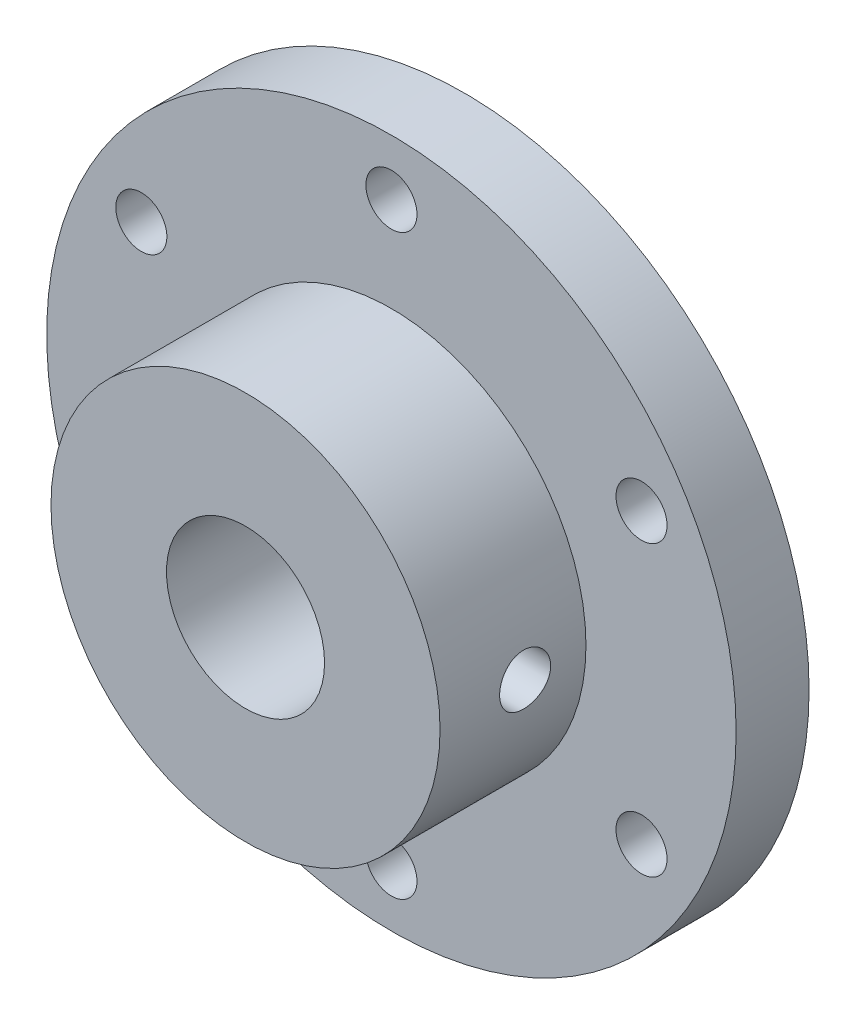
ISO-10303-21;
HEADER;
FILE_DESCRIPTION(('STEP AP214'),'2;1');
FILE_NAME('part.step','',(''),(''),'','','');
FILE_SCHEMA(('AUTOMOTIVE_DESIGN { 1 0 10303 214 1 1 1 1 }'));
ENDSEC;
DATA;
#1=APPLICATION_CONTEXT('core data for automotive mechanical design processes');
#2=APPLICATION_PROTOCOL_DEFINITION('international standard','automotive_design',2000,#1);
#3=PRODUCT_CONTEXT('',#1,'mechanical');
#4=PRODUCT('Part','Part','',(#3));
#5=PRODUCT_RELATED_PRODUCT_CATEGORY('part','',(#4));
#6=PRODUCT_DEFINITION_FORMATION('','',#4);
#7=PRODUCT_DEFINITION_CONTEXT('part definition',#1,'design');
#8=PRODUCT_DEFINITION('design','',#6,#7);
#9=PRODUCT_DEFINITION_SHAPE('','',#8);
#10=(LENGTH_UNIT() NAMED_UNIT(*) SI_UNIT(.MILLI.,.METRE.));
#11=(NAMED_UNIT(*) PLANE_ANGLE_UNIT() SI_UNIT($,.RADIAN.));
#12=(NAMED_UNIT(*) SI_UNIT($,.STERADIAN.) SOLID_ANGLE_UNIT());
#13=UNCERTAINTY_MEASURE_WITH_UNIT(LENGTH_MEASURE(1.E-05),#10,'distance_accuracy_value','');
#14=(GEOMETRIC_REPRESENTATION_CONTEXT(3) GLOBAL_UNCERTAINTY_ASSIGNED_CONTEXT((#13)) GLOBAL_UNIT_ASSIGNED_CONTEXT((#10,
#11,#12)) REPRESENTATION_CONTEXT('',''));
#15=CARTESIAN_POINT('',(0.,0.,0.));
#16=DIRECTION('',(0.,0.,1.));
#17=DIRECTION('',(1.,0.,0.));
#18=AXIS2_PLACEMENT_3D('',#15,#16,#17);
#19=CARTESIAN_POINT('',(0.,0.,6.));
#20=DIRECTION('',(0.,0.,-1.));
#21=DIRECTION('',(-1.,0.,0.));
#22=AXIS2_PLACEMENT_3D('',#19,#20,#21);
#23=CYLINDRICAL_SURFACE('',#22,28.35);
#24=CARTESIAN_POINT('',(0.,0.,6.));
#25=DIRECTION('',(0.,0.,1.));
#26=DIRECTION('',(1.,0.,0.));
#27=AXIS2_PLACEMENT_3D('',#24,#25,#26);
#28=CIRCLE('',#27,28.35);
#29=CARTESIAN_POINT('',(28.35,0.,6.));
#30=VERTEX_POINT('',#29);
#31=EDGE_CURVE('E10',#30,#30,#28,.T.);
#32=ORIENTED_EDGE('',*,*,#31,.F.);
#33=EDGE_LOOP('',(#32));
#34=FACE_BOUND('',#33,.T.);
#35=CARTESIAN_POINT('',(0.,0.,0.));
#36=DIRECTION('',(0.,0.,1.));
#37=DIRECTION('',(1.,0.,0.));
#38=AXIS2_PLACEMENT_3D('',#35,#36,#37);
#39=CIRCLE('',#38,28.35);
#40=CARTESIAN_POINT('',(28.35,0.,0.));
#41=VERTEX_POINT('',#40);
#42=EDGE_CURVE('E33',#41,#41,#39,.T.);
#43=ORIENTED_EDGE('',*,*,#42,.T.);
#44=EDGE_LOOP('',(#43));
#45=FACE_BOUND('',#44,.T.);
#46=ADVANCED_FACE('F30',(#34,#45),#23,.T.);
#47=CARTESIAN_POINT('',(0.,0.,6.));
#48=DIRECTION('',(0.,0.,1.));
#49=DIRECTION('',(1.,0.,0.));
#50=AXIS2_PLACEMENT_3D('',#47,#48,#49);
#51=PLANE('',#50);
#52=CARTESIAN_POINT('',(-20.5681033398804,-11.8750000000001,6.));
#53=DIRECTION('',(0.,0.,1.));
#54=DIRECTION('',(-0.500000000000004,0.866025403784436,0.));
#55=AXIS2_PLACEMENT_3D('',#52,#53,#54);
#56=CIRCLE('',#55,2.09999999999999);
#57=CARTESIAN_POINT('',(-21.6181033398804,-10.0563466520528,6.));
#58=VERTEX_POINT('',#57);
#59=EDGE_CURVE('E83',#58,#58,#56,.T.);
#60=ORIENTED_EDGE('',*,*,#59,.F.);
#61=EDGE_LOOP('',(#60));
#62=FACE_BOUND('',#61,.T.);
#63=CARTESIAN_POINT('',(0.,-23.75,6.));
#64=DIRECTION('',(0.,0.,1.));
#65=DIRECTION('',(-1.,0.,0.));
#66=AXIS2_PLACEMENT_3D('',#63,#64,#65);
#67=CIRCLE('',#66,2.09999999999999);
#68=CARTESIAN_POINT('',(-2.09999999999999,-23.75,6.));
#69=VERTEX_POINT('',#68);
#70=EDGE_CURVE('E77',#69,#69,#67,.T.);
#71=ORIENTED_EDGE('',*,*,#70,.F.);
#72=EDGE_LOOP('',(#71));
#73=FACE_BOUND('',#72,.T.);
#74=CARTESIAN_POINT('',(20.5681033398805,-11.8749999999998,6.));
#75=DIRECTION('',(0.,0.,1.));
#76=DIRECTION('',(-0.499999999999992,-0.866025403784443,0.));
#77=AXIS2_PLACEMENT_3D('',#74,#75,#76);
#78=CIRCLE('',#77,2.09999999999999);
#79=CARTESIAN_POINT('',(19.5181033398806,-13.6936533479471,6.));
#80=VERTEX_POINT('',#79);
#81=EDGE_CURVE('E69',#80,#80,#78,.T.);
#82=ORIENTED_EDGE('',*,*,#81,.F.);
#83=EDGE_LOOP('',(#82));
#84=FACE_BOUND('',#83,.T.);
#85=CARTESIAN_POINT('',(20.5681033398803,11.8750000000002,6.));
#86=DIRECTION('',(0.,0.,1.));
#87=DIRECTION('',(0.50000000000001,-0.866025403784433,0.));
#88=AXIS2_PLACEMENT_3D('',#85,#86,#87);
#89=CIRCLE('',#88,2.09999999999999);
#90=CARTESIAN_POINT('',(21.6181033398803,10.0563466520529,6.));
#91=VERTEX_POINT('',#90);
#92=EDGE_CURVE('E70',#91,#91,#89,.T.);
#93=ORIENTED_EDGE('',*,*,#92,.F.);
#94=EDGE_LOOP('',(#93));
#95=FACE_BOUND('',#94,.T.);
#96=CARTESIAN_POINT('',(-20.5681033398804,11.875,6.));
#97=DIRECTION('',(0.,0.,1.));
#98=DIRECTION('',(0.499999999999998,0.86602540378444,0.));
#99=AXIS2_PLACEMENT_3D('',#96,#97,#98);
#100=CIRCLE('',#99,2.09999999999999);
#101=CARTESIAN_POINT('',(-19.5181033398805,13.6936533479473,6.));
#102=VERTEX_POINT('',#101);
#103=EDGE_CURVE('E62',#102,#102,#100,.T.);
#104=ORIENTED_EDGE('',*,*,#103,.F.);
#105=EDGE_LOOP('',(#104));
#106=FACE_BOUND('',#105,.T.);
#107=CARTESIAN_POINT('',(0.,23.75,6.));
#108=DIRECTION('',(0.,0.,1.));
#109=DIRECTION('',(1.,0.,0.));
#110=AXIS2_PLACEMENT_3D('',#107,#108,#109);
#111=CIRCLE('',#110,2.09999999999999);
#112=CARTESIAN_POINT('',(2.09999999999999,23.75,6.));
#113=VERTEX_POINT('',#112);
#114=EDGE_CURVE('E51',#113,#113,#111,.T.);
#115=ORIENTED_EDGE('',*,*,#114,.F.);
#116=EDGE_LOOP('',(#115));
#117=FACE_BOUND('',#116,.T.);
#118=CARTESIAN_POINT('',(0.,0.,6.));
#119=DIRECTION('',(0.,0.,1.));
#120=DIRECTION('',(1.,0.,0.));
#121=AXIS2_PLACEMENT_3D('',#118,#119,#120);
#122=CIRCLE('',#121,16.);
#123=CARTESIAN_POINT('',(16.,0.,6.));
#124=VERTEX_POINT('',#123);
#125=EDGE_CURVE('E42',#124,#124,#122,.T.);
#126=ORIENTED_EDGE('',*,*,#125,.F.);
#127=EDGE_LOOP('',(#126));
#128=FACE_BOUND('',#127,.T.);
#129=ORIENTED_EDGE('',*,*,#31,.T.);
#130=EDGE_LOOP('',(#129));
#131=FACE_BOUND('',#130,.T.);
#132=ADVANCED_FACE('F143',(#62,#73,#84,#95,#106,#117,#128,#131),#51,.T.);
#133=CARTESIAN_POINT('',(0.,0.,0.));
#134=DIRECTION('',(0.,0.,1.));
#135=DIRECTION('',(1.,0.,0.));
#136=AXIS2_PLACEMENT_3D('',#133,#134,#135);
#137=PLANE('',#136);
#138=CARTESIAN_POINT('',(-20.5681033398804,-11.8750000000001,0.));
#139=DIRECTION('',(0.,0.,-1.));
#140=DIRECTION('',(0.500000000000004,-0.866025403784436,0.));
#141=AXIS2_PLACEMENT_3D('',#138,#139,#140);
#142=CIRCLE('',#141,2.09999999999999);
#143=CARTESIAN_POINT('',(-19.5181033398804,-13.6936533479474,0.));
#144=VERTEX_POINT('',#143);
#145=EDGE_CURVE('E65',#144,#144,#142,.T.);
#146=ORIENTED_EDGE('',*,*,#145,.F.);
#147=EDGE_LOOP('',(#146));
#148=FACE_BOUND('',#147,.T.);
#149=CARTESIAN_POINT('',(0.,-23.75,0.));
#150=DIRECTION('',(0.,0.,-1.));
#151=DIRECTION('',(1.,0.,0.));
#152=AXIS2_PLACEMENT_3D('',#149,#150,#151);
#153=CIRCLE('',#152,2.09999999999999);
#154=CARTESIAN_POINT('',(2.09999999999999,-23.75,0.));
#155=VERTEX_POINT('',#154);
#156=EDGE_CURVE('E80',#155,#155,#153,.T.);
#157=ORIENTED_EDGE('',*,*,#156,.F.);
#158=EDGE_LOOP('',(#157));
#159=FACE_BOUND('',#158,.T.);
#160=CARTESIAN_POINT('',(20.5681033398805,-11.8749999999998,0.));
#161=DIRECTION('',(0.,0.,-1.));
#162=DIRECTION('',(0.499999999999992,0.866025403784443,0.));
#163=AXIS2_PLACEMENT_3D('',#160,#161,#162);
#164=CIRCLE('',#163,2.09999999999999);
#165=CARTESIAN_POINT('',(21.6181033398805,-10.0563466520525,0.));
#166=VERTEX_POINT('',#165);
#167=EDGE_CURVE('E74',#166,#166,#164,.T.);
#168=ORIENTED_EDGE('',*,*,#167,.F.);
#169=EDGE_LOOP('',(#168));
#170=FACE_BOUND('',#169,.T.);
#171=CARTESIAN_POINT('',(20.5681033398803,11.8750000000002,0.));
#172=DIRECTION('',(0.,0.,-1.));
#173=DIRECTION('',(-0.50000000000001,0.866025403784433,0.));
#174=AXIS2_PLACEMENT_3D('',#171,#172,#173);
#175=CIRCLE('',#174,2.09999999999999);
#176=CARTESIAN_POINT('',(19.5181033398803,13.6936533479475,0.));
#177=VERTEX_POINT('',#176);
#178=EDGE_CURVE('E66',#177,#177,#175,.T.);
#179=ORIENTED_EDGE('',*,*,#178,.F.);
#180=EDGE_LOOP('',(#179));
#181=FACE_BOUND('',#180,.T.);
#182=CARTESIAN_POINT('',(-20.5681033398804,11.875,0.));
#183=DIRECTION('',(0.,0.,-1.));
#184=DIRECTION('',(-0.499999999999998,-0.86602540378444,0.));
#185=AXIS2_PLACEMENT_3D('',#182,#183,#184);
#186=CIRCLE('',#185,2.09999999999999);
#187=CARTESIAN_POINT('',(-21.6181033398804,10.0563466520526,0.));
#188=VERTEX_POINT('',#187);
#189=EDGE_CURVE('E59',#188,#188,#186,.T.);
#190=ORIENTED_EDGE('',*,*,#189,.F.);
#191=EDGE_LOOP('',(#190));
#192=FACE_BOUND('',#191,.T.);
#193=CARTESIAN_POINT('',(0.,23.75,0.));
#194=DIRECTION('',(0.,0.,-1.));
#195=DIRECTION('',(-1.,0.,0.));
#196=AXIS2_PLACEMENT_3D('',#193,#194,#195);
#197=CIRCLE('',#196,2.09999999999999);
#198=CARTESIAN_POINT('',(-2.09999999999999,23.75,0.));
#199=VERTEX_POINT('',#198);
#200=EDGE_CURVE('E56',#199,#199,#197,.T.);
#201=ORIENTED_EDGE('',*,*,#200,.F.);
#202=EDGE_LOOP('',(#201));
#203=FACE_BOUND('',#202,.T.);
#204=CARTESIAN_POINT('',(0.,0.,0.));
#205=DIRECTION('',(0.,0.,1.));
#206=DIRECTION('',(1.,0.,0.));
#207=AXIS2_PLACEMENT_3D('',#204,#205,#206);
#208=CIRCLE('',#207,6.5);
#209=CARTESIAN_POINT('',(6.5,0.,0.));
#210=VERTEX_POINT('',#209);
#211=EDGE_CURVE('E45',#210,#210,#208,.T.);
#212=ORIENTED_EDGE('',*,*,#211,.T.);
#213=EDGE_LOOP('',(#212));
#214=FACE_BOUND('',#213,.T.);
#215=ORIENTED_EDGE('',*,*,#42,.F.);
#216=EDGE_LOOP('',(#215));
#217=FACE_BOUND('',#216,.T.);
#218=ADVANCED_FACE('F141',(#148,#159,#170,#181,#192,#203,#214,#217),#137,.F.);
#219=CARTESIAN_POINT('',(0.,0.,18.));
#220=DIRECTION('',(0.,0.,-1.));
#221=DIRECTION('',(-1.,0.,0.));
#222=AXIS2_PLACEMENT_3D('',#219,#220,#221);
#223=CYLINDRICAL_SURFACE('',#222,16.);
#224=CARTESIAN_POINT('',(16.,0.,8.9));
#225=CARTESIAN_POINT('',(15.9999982962631,0.117416484353102,8.90000495705236));
#226=CARTESIAN_POINT('',(15.9986938773925,0.234905122011887,8.90988080691643));
#227=CARTESIAN_POINT('',(15.9936157778764,0.466609665583491,8.94911967052718));
#228=CARTESIAN_POINT('',(15.9898395595276,0.580822081998048,8.97850271201433));
#229=CARTESIAN_POINT('',(15.9802430281394,0.802586512568987,9.0558724099226));
#230=CARTESIAN_POINT('',(15.9744241309754,0.910143079615394,9.10384618263218));
#231=CARTESIAN_POINT('',(15.9613884397463,1.1156593399402,9.21700655797674));
#232=CARTESIAN_POINT('',(15.9541718747973,1.21362060219517,9.28219034005324));
#233=CARTESIAN_POINT('',(15.9390970395828,1.39777717587375,9.4283413083698));
#234=CARTESIAN_POINT('',(15.9312355150333,1.48390610575507,9.50939181113075));
#235=CARTESIAN_POINT('',(15.9157828604001,1.64138117851605,9.68479647193949));
#236=CARTESIAN_POINT('',(15.908191744508,1.71272654645484,9.77915132695387));
#237=CARTESIAN_POINT('',(15.8941075163014,1.83885928171324,9.9789213126258));
#238=CARTESIAN_POINT('',(15.8876186009931,1.89358395666576,10.0843763480338));
#239=CARTESIAN_POINT('',(15.8765168113299,1.98452144739535,10.3030795517579));
#240=CARTESIAN_POINT('',(15.8719038586674,2.02073503589053,10.4163273945506));
#241=CARTESIAN_POINT('',(15.8651076274545,2.0734195616491,10.6467101739999));
#242=CARTESIAN_POINT('',(15.8629105101852,2.0900029894288,10.7638189706013));
#243=CARTESIAN_POINT('',(15.8611524584727,2.10330463008907,10.9991763708029));
#244=CARTESIAN_POINT('',(15.8615914075016,2.10002372107694,11.1174249237892));
#245=CARTESIAN_POINT('',(15.8650432287045,2.07378206445453,11.3509187553438));
#246=CARTESIAN_POINT('',(15.86803985239,2.05094554741099,11.4661782702577));
#247=CARTESIAN_POINT('',(15.8762440291591,1.98643489899058,11.6912149779756));
#248=CARTESIAN_POINT('',(15.8814516312202,1.94476035031288,11.8009920492725));
#249=CARTESIAN_POINT('',(15.8935093147413,1.84362411100889,12.0123317781193));
#250=CARTESIAN_POINT('',(15.9003643391794,1.78410875473803,12.1138684605443));
#251=CARTESIAN_POINT('',(15.9149407211294,1.64901867206017,12.3055604124573));
#252=CARTESIAN_POINT('',(15.9226621222936,1.57344313629226,12.395715107979));
#253=CARTESIAN_POINT('',(15.9381733835384,1.40769104741128,12.5628047526722));
#254=CARTESIAN_POINT('',(15.9459633163989,1.31740747591083,12.6396335731953));
#255=CARTESIAN_POINT('',(15.9606788849759,1.12516973659487,12.7770631591691));
#256=CARTESIAN_POINT('',(15.9676045183355,1.02321553695397,12.8376638803649));
#257=CARTESIAN_POINT('',(15.9798160936183,0.81044643682083,12.9409183626589));
#258=CARTESIAN_POINT('',(15.9851013953531,0.699628098002016,12.9835651189946));
#259=CARTESIAN_POINT('',(15.9934311173904,0.472318289200564,13.0496149743927));
#260=CARTESIAN_POINT('',(15.9964756534268,0.355827112547463,13.0730190673325));
#261=CARTESIAN_POINT('',(15.9999656992249,0.12139562938738,13.0997808566157));
#262=CARTESIAN_POINT('',(16.0004301540478,0.00347227541262437,13.103284681241));
#263=CARTESIAN_POINT('',(15.9987589549612,-0.231280014343777,13.0905326292899));
#264=CARTESIAN_POINT('',(15.9966233622396,-0.348108975814989,13.0742772177153));
#265=CARTESIAN_POINT('',(15.990003800972,-0.57692228410594,13.0225895536893));
#266=CARTESIAN_POINT('',(15.9855284102365,-0.688922719796447,12.9872273319612));
#267=CARTESIAN_POINT('',(15.974730073111,-0.905403997412976,12.8984029024912));
#268=CARTESIAN_POINT('',(15.9684070581947,-1.00988456025589,12.8449400234038));
#269=CARTESIAN_POINT('',(15.9545706371482,-1.2090105555854,12.721080854769));
#270=CARTESIAN_POINT('',(15.947050698098,-1.30359699513709,12.6505904659569));
#271=CARTESIAN_POINT('',(15.9316811346644,-1.47964872574463,12.4948098674338));
#272=CARTESIAN_POINT('',(15.9238314958089,-1.56111344006267,12.4095190075414));
#273=CARTESIAN_POINT('',(15.9086283992346,-1.70913080865221,12.2259132317372));
#274=CARTESIAN_POINT('',(15.9012783770394,-1.77558633636806,12.1275196890213));
#275=CARTESIAN_POINT('',(15.8879642527691,-1.89102695628024,11.9208813855286));
#276=CARTESIAN_POINT('',(15.8820001205454,-1.94001242853153,11.8126368391213));
#277=CARTESIAN_POINT('',(15.8721568354206,-2.01896672841903,11.5896770175875));
#278=CARTESIAN_POINT('',(15.8682717771357,-2.04898946191644,11.4749811034711));
#279=CARTESIAN_POINT('',(15.8630098837321,-2.08933920892608,11.242121268751));
#280=CARTESIAN_POINT('',(15.8616329189455,-2.09966724065019,11.1239575277539));
#281=CARTESIAN_POINT('',(15.8615471546198,-2.10031443069061,10.8884829294453));
#282=CARTESIAN_POINT('',(15.8628180045269,-2.09078619999575,10.7711724699154));
#283=CARTESIAN_POINT('',(15.8678408142836,-2.05231540968838,10.5398362007954));
#284=CARTESIAN_POINT('',(15.8715927735212,-2.02337285486407,10.4258103903953));
#285=CARTESIAN_POINT('',(15.8811485642185,-1.94694420408523,10.2043055075203));
#286=CARTESIAN_POINT('',(15.8869514953252,-1.89946624400469,10.096823586585));
#287=CARTESIAN_POINT('',(15.8999567709492,-1.78732950445978,9.89132723687448));
#288=CARTESIAN_POINT('',(15.9071591400699,-1.7226704229297,9.79331297459389));
#289=CARTESIAN_POINT('',(15.9222180092564,-1.57744326503153,9.60875508025564));
#290=CARTESIAN_POINT('',(15.9300789344295,-1.49676157774286,9.52230120152492));
#291=CARTESIAN_POINT('',(15.9455305998353,-1.32201773458277,9.36410229468749));
#292=CARTESIAN_POINT('',(15.9531212761728,-1.22795244033518,9.29236072619036));
#293=CARTESIAN_POINT('',(15.9672126278133,-1.02865642383035,9.16536363306548));
#294=CARTESIAN_POINT('',(15.9737086069784,-0.923380607893781,9.11017838182219));
#295=CARTESIAN_POINT('',(15.9848315489309,-0.705026961411323,9.01835047192647));
#296=CARTESIAN_POINT('',(15.9894605194548,-0.591957665878867,8.98168788366503));
#297=CARTESIAN_POINT('',(15.9952257223333,-0.398600577498265,8.93661582244385));
#298=CARTESIAN_POINT('',(15.9970072452264,-0.319526543474694,8.92290490974843));
#299=CARTESIAN_POINT('',(15.9993949607654,-0.160312880332424,8.90459534461191));
#300=CARTESIAN_POINT('',(16.0000011633302,-0.0801732602122652,8.89999661527041));
#301=CARTESIAN_POINT('',(16.,0.,8.9));
#302=B_SPLINE_CURVE_WITH_KNOTS('',3,(#224,#225,#226,#227,#228,#229,#230,#231,#232,#233,#234,
#235,#236,#237,#238,#239,#240,#241,#242,#243,#244,#245,#246,#247,#248,#249,#250,#251,#252,#253,
#254,#255,#256,#257,#258,#259,#260,#261,#262,#263,#264,#265,#266,#267,#268,#269,#270,#271,#272,
#273,#274,#275,#276,#277,#278,#279,#280,#281,#282,#283,#284,#285,#286,#287,#288,#289,#290,#291,
#292,#293,#294,#295,#296,#297,#298,#299,#300,#301),.UNSPECIFIED.,.T.,.F.,(4,2,2,2,2,2,2,2,2,2,2,
2,2,2,2,2,2,2,2,2,2,2,2,2,2,2,2,2,2,2,2,2,2,2,2,2,2,2,4),(0.,0.351956579597512,
0.704275067694988,1.05634982812868,1.40836692260358,1.76228460352201,2.11622083179281,
2.47147596652804,2.82671627044793,3.17991086217002,3.53308984096312,3.88404169036012,
4.2350013144372,4.58702741286475,4.9390712560353,5.29380151830567,5.64853274793558,
6.00340224843457,6.35825341888271,6.71049550361346,7.06272929905446,7.41368075090289,
7.76464522081314,8.11759548065947,8.47056124946069,8.82574953425382,9.18093009157842,
9.53509636913481,9.88924433587379,10.2406804386663,10.5921164547833,10.9433983857755,
11.2946864931543,11.6485606276522,12.0025178807118,12.3579569170413,12.7130126970205,
12.9533345286082,13.1936543320409),.UNSPECIFIED.);
#303=CARTESIAN_POINT('',(16.,0.,8.9));
#304=VERTEX_POINT('',#303);
#305=EDGE_CURVE('E73',#304,#304,#302,.T.);
#306=ORIENTED_EDGE('',*,*,#305,.F.);
#307=EDGE_LOOP('',(#306));
#308=FACE_BOUND('',#307,.T.);
#309=CARTESIAN_POINT('',(0.,0.,18.));
#310=DIRECTION('',(0.,0.,1.));
#311=DIRECTION('',(1.,0.,0.));
#312=AXIS2_PLACEMENT_3D('',#309,#310,#311);
#313=CIRCLE('',#312,16.);
#314=CARTESIAN_POINT('',(16.,0.,18.));
#315=VERTEX_POINT('',#314);
#316=EDGE_CURVE('E40',#315,#315,#313,.T.);
#317=ORIENTED_EDGE('',*,*,#316,.F.);
#318=EDGE_LOOP('',(#317));
#319=FACE_BOUND('',#318,.T.);
#320=ORIENTED_EDGE('',*,*,#125,.T.);
#321=EDGE_LOOP('',(#320));
#322=FACE_BOUND('',#321,.T.);
#323=ADVANCED_FACE('F137',(#308,#319,#322),#223,.T.);
#324=CARTESIAN_POINT('',(0.,0.,18.));
#325=DIRECTION('',(0.,0.,1.));
#326=DIRECTION('',(1.,0.,0.));
#327=AXIS2_PLACEMENT_3D('',#324,#325,#326);
#328=PLANE('',#327);
#329=CARTESIAN_POINT('',(0.,0.,18.));
#330=DIRECTION('',(0.,0.,1.));
#331=DIRECTION('',(1.,0.,0.));
#332=AXIS2_PLACEMENT_3D('',#329,#330,#331);
#333=CIRCLE('',#332,6.5);
#334=CARTESIAN_POINT('',(6.5,0.,18.));
#335=VERTEX_POINT('',#334);
#336=EDGE_CURVE('E48',#335,#335,#333,.T.);
#337=ORIENTED_EDGE('',*,*,#336,.F.);
#338=EDGE_LOOP('',(#337));
#339=FACE_BOUND('',#338,.T.);
#340=ORIENTED_EDGE('',*,*,#316,.T.);
#341=EDGE_LOOP('',(#340));
#342=FACE_BOUND('',#341,.T.);
#343=ADVANCED_FACE('F133',(#339,#342),#328,.T.);
#344=CARTESIAN_POINT('',(0.,0.,0.));
#345=DIRECTION('',(0.,0.,1.));
#346=DIRECTION('',(1.,0.,0.));
#347=AXIS2_PLACEMENT_3D('',#344,#345,#346);
#348=CYLINDRICAL_SURFACE('',#347,6.5);
#349=CARTESIAN_POINT('',(6.5,0.,8.9));
#350=CARTESIAN_POINT('',(6.49999984762594,-0.11478015267852,8.90000013326097));
#351=CARTESIAN_POINT('',(6.49693136614676,-0.229562646212126,8.90944116425099));
#352=CARTESIAN_POINT('',(6.48499201245018,-0.455758735968136,8.94684858951265));
#353=CARTESIAN_POINT('',(6.47612018587026,-0.567171774928909,8.97481803079873));
#354=CARTESIAN_POINT('',(6.45354073761235,-0.783334943692378,9.04823192886978));
#355=CARTESIAN_POINT('',(6.43984090576822,-0.888095487627853,9.09364824624092));
#356=CARTESIAN_POINT('',(6.40901183916854,-1.08851351392821,9.20054322424069));
#357=CARTESIAN_POINT('',(6.39188199424108,-1.18416937216913,9.2620247433346));
#358=CARTESIAN_POINT('',(6.35537555243329,-1.36679767568749,9.40142339988139));
#359=CARTESIAN_POINT('',(6.33594753880125,-1.45343019593023,9.47977234832067));
#360=CARTESIAN_POINT('',(6.29732467015338,-1.61258241008024,9.64976310716213));
#361=CARTESIAN_POINT('',(6.27812986315358,-1.6850992423096,9.74140760641673));
#362=CARTESIAN_POINT('',(6.24158803844324,-1.81585313888028,9.93838942073292));
#363=CARTESIAN_POINT('',(6.22430408492323,-1.87365695616513,10.0440271375786));
#364=CARTESIAN_POINT('',(6.19431848653863,-1.97053521369596,10.2641730612946));
#365=CARTESIAN_POINT('',(6.18161553983706,-2.00961497600927,10.3786787368016));
#366=CARTESIAN_POINT('',(6.16276983931889,-2.06667622660958,10.6094591201013));
#367=CARTESIAN_POINT('',(6.15643057256345,-2.0852915301278,10.7255606061229));
#368=CARTESIAN_POINT('',(6.15044761140108,-2.10287625070446,10.9593986910689));
#369=CARTESIAN_POINT('',(6.15080199454799,-2.101851308528,11.0771348108124));
#370=CARTESIAN_POINT('',(6.15799345504348,-2.08067854494973,11.3055768377815));
#371=CARTESIAN_POINT('',(6.16455379741828,-2.06134700904493,11.4163686019231));
#372=CARTESIAN_POINT('',(6.18296679592779,-2.00543737492302,11.6330430309594));
#373=CARTESIAN_POINT('',(6.1948200499337,-1.96885732834052,11.7389251397825));
#374=CARTESIAN_POINT('',(6.22268788340782,-1.87893383724714,11.94467403774));
#375=CARTESIAN_POINT('',(6.23876362994827,-1.82534134925149,12.0444233394089));
#376=CARTESIAN_POINT('',(6.2732382947439,-1.70308717246323,12.2337759870639));
#377=CARTESIAN_POINT('',(6.29163785022376,-1.6344213464996,12.3233765372721));
#378=CARTESIAN_POINT('',(6.32978643852367,-1.48000669369173,12.4944892936782));
#379=CARTESIAN_POINT('',(6.34955748594388,-1.39358721886844,12.5753925649043));
#380=CARTESIAN_POINT('',(6.38743186866717,-1.20816261133916,12.7217118952384));
#381=CARTESIAN_POINT('',(6.40553506275021,-1.10915641457954,12.7871266436411));
#382=CARTESIAN_POINT('',(6.43824721057395,-0.900136372310454,12.9010630861593));
#383=CARTESIAN_POINT('',(6.45282391669772,-0.790033092396686,12.9494305995234));
#384=CARTESIAN_POINT('',(6.47660732137455,-0.562670821437449,13.0267726307963));
#385=CARTESIAN_POINT('',(6.48581576747844,-0.4454141728024,13.0557534601823));
#386=CARTESIAN_POINT('',(6.49753974554395,-0.2122355686941,13.0924414490988));
#387=CARTESIAN_POINT('',(6.50031423039758,-0.0964560310383877,13.1009721849127));
#388=CARTESIAN_POINT('',(6.49962893282386,0.134897611158433,13.0988518883504));
#389=CARTESIAN_POINT('',(6.49617013124436,0.250471745156622,13.0882038738745));
#390=CARTESIAN_POINT('',(6.48357748396053,0.474897398486163,13.0486849183147));
#391=CARTESIAN_POINT('',(6.47459876244501,0.583846122334336,13.0203117592815));
#392=CARTESIAN_POINT('',(6.4520280403984,0.795399868811156,12.9467627922165));
#393=CARTESIAN_POINT('',(6.43843545964271,0.898004091655654,12.9015848708016));
#394=CARTESIAN_POINT('',(6.40759659592119,1.09685611026068,12.7944320236055));
#395=CARTESIAN_POINT('',(6.39026632979125,1.19287645758089,12.7320598528519));
#396=CARTESIAN_POINT('',(6.35392571159687,1.37335993471932,12.5927605608013));
#397=CARTESIAN_POINT('',(6.33491487544933,1.45781971658139,12.5158292384573));
#398=CARTESIAN_POINT('',(6.29633442103443,1.61651818338125,12.3457209755327));
#399=CARTESIAN_POINT('',(6.27677542522803,1.69016938349652,12.2519922563222));
#400=CARTESIAN_POINT('',(6.24014795835414,1.82076055180556,12.053082794392));
#401=CARTESIAN_POINT('',(6.22307947542276,1.87770059960644,11.9479021062294));
#402=CARTESIAN_POINT('',(6.19354517835395,1.97293988416012,11.7291691602628));
#403=CARTESIAN_POINT('',(6.18106547836716,2.0112954720899,11.6156434271912));
#404=CARTESIAN_POINT('',(6.16226449334382,2.06819042623144,11.3832533722931));
#405=CARTESIAN_POINT('',(6.15594065306915,2.08673801486373,11.2643912869866));
#406=CARTESIAN_POINT('',(6.15044597744328,2.10287398644436,11.0308786474295));
#407=CARTESIAN_POINT('',(6.1509443099754,2.1014317073017,10.9163020737839));
#408=CARTESIAN_POINT('',(6.15822697913326,2.07999175555092,10.6891122898019));
#409=CARTESIAN_POINT('',(6.1650109834417,2.05999506389632,10.5764989759905));
#410=CARTESIAN_POINT('',(6.18386170119516,2.0026819067383,10.3582971845668));
#411=CARTESIAN_POINT('',(6.19583805979404,1.96566104718839,10.2526226560169));
#412=CARTESIAN_POINT('',(6.22369569223963,1.87558632651302,10.0489019638837));
#413=CARTESIAN_POINT('',(6.23957779800492,1.82252904910129,9.95085743134324));
#414=CARTESIAN_POINT('',(6.27427773405697,1.69932067816035,9.7607816701388));
#415=CARTESIAN_POINT('',(6.29318990404038,1.62855266631233,9.66916762849268));
#416=CARTESIAN_POINT('',(6.33140503172638,1.47299576999185,9.49880177489966));
#417=CARTESIAN_POINT('',(6.35070809559453,1.38820303038323,9.42005351137916));
#418=CARTESIAN_POINT('',(6.38835851966061,1.20335860583316,9.27482546498718));
#419=CARTESIAN_POINT('',(6.40664701425018,1.10286967112843,9.20888514525647));
#420=CARTESIAN_POINT('',(6.43943829822981,0.891645850173484,9.09491304176281));
#421=CARTESIAN_POINT('',(6.45394231934155,0.780914313486271,9.04687542907176));
#422=CARTESIAN_POINT('',(6.4767469097158,0.559731443724438,8.97283194592696));
#423=CARTESIAN_POINT('',(6.48538779223929,0.449724427071784,8.94560293582374));
#424=CARTESIAN_POINT('',(6.49701374152978,0.226478517537958,8.90918903792171));
#425=CARTESIAN_POINT('',(6.50000015032999,0.113240398005008,8.89999986852671));
#426=CARTESIAN_POINT('',(6.5,0.,8.9));
#427=B_SPLINE_CURVE_WITH_KNOTS('',3,(#349,#350,#351,#352,#353,#354,#355,#356,#357,#358,#359,
#360,#361,#362,#363,#364,#365,#366,#367,#368,#369,#370,#371,#372,#373,#374,#375,#376,#377,#378,
#379,#380,#381,#382,#383,#384,#385,#386,#387,#388,#389,#390,#391,#392,#393,#394,#395,#396,#397,
#398,#399,#400,#401,#402,#403,#404,#405,#406,#407,#408,#409,#410,#411,#412,#413,#414,#415,#416,
#417,#418,#419,#420,#421,#422,#423,#424,#425,#426),.UNSPECIFIED.,.T.,.F.,(4,2,2,2,2,2,2,2,2,2,2,
2,2,2,2,2,2,2,2,2,2,2,2,2,2,2,2,2,2,2,2,2,2,2,2,2,2,2,4),(0.,0.343923981095444,
0.687904534857075,1.0313326088658,1.37482183034691,1.72845644393134,2.08216267547618,
2.4453183332506,2.80837070746089,3.15983101194152,3.51119037698753,3.84758565907629,
4.18401894896814,4.52562389865709,4.86732272596724,5.22571361317307,5.58413481812311,
5.94571918962466,6.30718578731836,6.65383086592771,7.00042140245966,7.33769086053154,
7.67500274828454,8.02087649799565,8.36685020225929,8.72753837967963,9.08822483885801,
9.44781068404835,9.80724720488736,10.1493177330619,10.4913701773347,10.8276953457348,
11.1640922130562,11.5144204767655,11.8648451997129,12.2278019086183,12.5906403392817,
12.9300312044731,13.2693415085097),.UNSPECIFIED.);
#428=CARTESIAN_POINT('',(6.5,0.,8.9));
#429=VERTEX_POINT('',#428);
#430=EDGE_CURVE('E97',#429,#429,#427,.T.);
#431=ORIENTED_EDGE('',*,*,#430,.F.);
#432=EDGE_LOOP('',(#431));
#433=FACE_BOUND('',#432,.T.);
#434=ORIENTED_EDGE('',*,*,#211,.F.);
#435=EDGE_LOOP('',(#434));
#436=FACE_BOUND('',#435,.T.);
#437=ORIENTED_EDGE('',*,*,#336,.T.);
#438=EDGE_LOOP('',(#437));
#439=FACE_BOUND('',#438,.T.);
#440=ADVANCED_FACE('F129',(#433,#436,#439),#348,.F.);
#441=CARTESIAN_POINT('',(0.,23.75,0.));
#442=DIRECTION('',(0.,0.,-1.));
#443=DIRECTION('',(-1.,0.,0.));
#444=AXIS2_PLACEMENT_3D('',#441,#442,#443);
#445=CYLINDRICAL_SURFACE('',#444,2.09999999999999);
#446=ORIENTED_EDGE('',*,*,#114,.T.);
#447=EDGE_LOOP('',(#446));
#448=FACE_BOUND('',#447,.T.);
#449=ORIENTED_EDGE('',*,*,#200,.T.);
#450=EDGE_LOOP('',(#449));
#451=FACE_BOUND('',#450,.T.);
#452=ADVANCED_FACE('F125',(#448,#451),#445,.F.);
#453=CARTESIAN_POINT('',(-20.5681033398804,11.875,0.));
#454=DIRECTION('',(0.,0.,-1.));
#455=DIRECTION('',(-0.499999999999998,-0.86602540378444,0.));
#456=AXIS2_PLACEMENT_3D('',#453,#454,#455);
#457=CYLINDRICAL_SURFACE('',#456,2.09999999999999);
#458=ORIENTED_EDGE('',*,*,#103,.T.);
#459=EDGE_LOOP('',(#458));
#460=FACE_BOUND('',#459,.T.);
#461=ORIENTED_EDGE('',*,*,#189,.T.);
#462=EDGE_LOOP('',(#461));
#463=FACE_BOUND('',#462,.T.);
#464=ADVANCED_FACE('F121',(#460,#463),#457,.F.);
#465=CARTESIAN_POINT('',(20.5681033398803,11.8750000000002,0.));
#466=DIRECTION('',(0.,0.,-1.));
#467=DIRECTION('',(-0.50000000000001,0.866025403784433,0.));
#468=AXIS2_PLACEMENT_3D('',#465,#466,#467);
#469=CYLINDRICAL_SURFACE('',#468,2.09999999999999);
#470=ORIENTED_EDGE('',*,*,#92,.T.);
#471=EDGE_LOOP('',(#470));
#472=FACE_BOUND('',#471,.T.);
#473=ORIENTED_EDGE('',*,*,#178,.T.);
#474=EDGE_LOOP('',(#473));
#475=FACE_BOUND('',#474,.T.);
#476=ADVANCED_FACE('F117',(#472,#475),#469,.F.);
#477=CARTESIAN_POINT('',(20.5681033398805,-11.8749999999998,0.));
#478=DIRECTION('',(0.,0.,-1.));
#479=DIRECTION('',(0.499999999999992,0.866025403784443,0.));
#480=AXIS2_PLACEMENT_3D('',#477,#478,#479);
#481=CYLINDRICAL_SURFACE('',#480,2.09999999999999);
#482=ORIENTED_EDGE('',*,*,#81,.T.);
#483=EDGE_LOOP('',(#482));
#484=FACE_BOUND('',#483,.T.);
#485=ORIENTED_EDGE('',*,*,#167,.T.);
#486=EDGE_LOOP('',(#485));
#487=FACE_BOUND('',#486,.T.);
#488=ADVANCED_FACE('F113',(#484,#487),#481,.F.);
#489=CARTESIAN_POINT('',(0.,-23.75,0.));
#490=DIRECTION('',(0.,0.,-1.));
#491=DIRECTION('',(1.,0.,0.));
#492=AXIS2_PLACEMENT_3D('',#489,#490,#491);
#493=CYLINDRICAL_SURFACE('',#492,2.09999999999999);
#494=ORIENTED_EDGE('',*,*,#70,.T.);
#495=EDGE_LOOP('',(#494));
#496=FACE_BOUND('',#495,.T.);
#497=ORIENTED_EDGE('',*,*,#156,.T.);
#498=EDGE_LOOP('',(#497));
#499=FACE_BOUND('',#498,.T.);
#500=ADVANCED_FACE('F109',(#496,#499),#493,.F.);
#501=CARTESIAN_POINT('',(-20.5681033398804,-11.8750000000001,0.));
#502=DIRECTION('',(0.,0.,-1.));
#503=DIRECTION('',(0.500000000000004,-0.866025403784436,0.));
#504=AXIS2_PLACEMENT_3D('',#501,#502,#503);
#505=CYLINDRICAL_SURFACE('',#504,2.09999999999999);
#506=ORIENTED_EDGE('',*,*,#59,.T.);
#507=EDGE_LOOP('',(#506));
#508=FACE_BOUND('',#507,.T.);
#509=ORIENTED_EDGE('',*,*,#145,.T.);
#510=EDGE_LOOP('',(#509));
#511=FACE_BOUND('',#510,.T.);
#512=ADVANCED_FACE('F106',(#508,#511),#505,.F.);
#513=CARTESIAN_POINT('',(-28.351,0.,11.));
#514=DIRECTION('',(1.,0.,0.));
#515=DIRECTION('',(0.,0.,-1.));
#516=AXIS2_PLACEMENT_3D('',#513,#514,#515);
#517=CYLINDRICAL_SURFACE('',#516,2.1);
#518=ORIENTED_EDGE('',*,*,#430,.T.);
#519=EDGE_LOOP('',(#518));
#520=FACE_BOUND('',#519,.T.);
#521=ORIENTED_EDGE('',*,*,#305,.T.);
#522=EDGE_LOOP('',(#521));
#523=FACE_BOUND('',#522,.T.);
#524=ADVANCED_FACE('F102',(#520,#523),#517,.F.);
#525=CLOSED_SHELL('',(#46,#132,#218,#323,#343,#440,#452,#464,#476,#488,#500,#512,#524));
#526=MANIFOLD_SOLID_BREP('B2',#525);
#527=ADVANCED_BREP_SHAPE_REPRESENTATION('',(#18,#526),#14);
#528=SHAPE_DEFINITION_REPRESENTATION(#9,#527);
ENDSEC;
END-ISO-10303-21;
